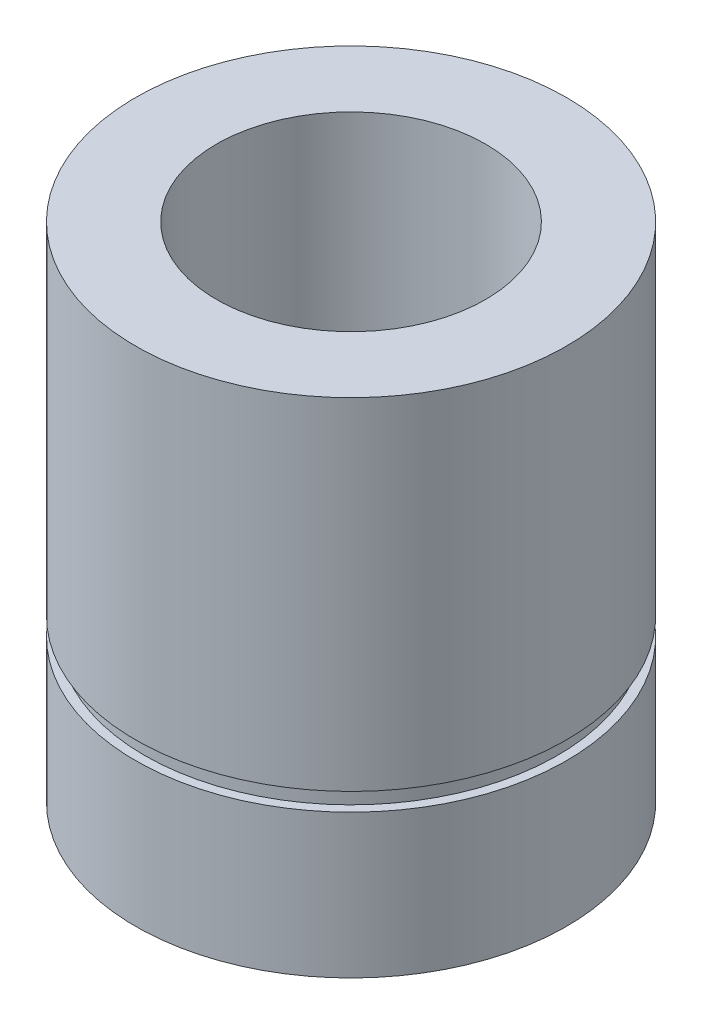
ISO-10303-21;
HEADER;
FILE_DESCRIPTION(('STEP AP214'),'2;1');
FILE_NAME('part.step','',(''),(''),'','','');
FILE_SCHEMA(('AUTOMOTIVE_DESIGN { 1 0 10303 214 1 1 1 1 }'));
ENDSEC;
DATA;
#1=APPLICATION_CONTEXT('core data for automotive mechanical design processes');
#2=APPLICATION_PROTOCOL_DEFINITION('international standard','automotive_design',2000,#1);
#3=PRODUCT_CONTEXT('',#1,'mechanical');
#4=PRODUCT('Part','Part','',(#3));
#5=PRODUCT_RELATED_PRODUCT_CATEGORY('part','',(#4));
#6=PRODUCT_DEFINITION_FORMATION('','',#4);
#7=PRODUCT_DEFINITION_CONTEXT('part definition',#1,'design');
#8=PRODUCT_DEFINITION('design','',#6,#7);
#9=PRODUCT_DEFINITION_SHAPE('','',#8);
#10=(LENGTH_UNIT() NAMED_UNIT(*) SI_UNIT(.MILLI.,.METRE.));
#11=(NAMED_UNIT(*) PLANE_ANGLE_UNIT() SI_UNIT($,.RADIAN.));
#12=(NAMED_UNIT(*) SI_UNIT($,.STERADIAN.) SOLID_ANGLE_UNIT());
#13=UNCERTAINTY_MEASURE_WITH_UNIT(LENGTH_MEASURE(1.E-05),#10,'distance_accuracy_value','');
#14=(GEOMETRIC_REPRESENTATION_CONTEXT(3) GLOBAL_UNCERTAINTY_ASSIGNED_CONTEXT((#13)) GLOBAL_UNIT_ASSIGNED_CONTEXT((#10,
#11,#12)) REPRESENTATION_CONTEXT('',''));
#15=CARTESIAN_POINT('',(0.,0.,0.));
#16=DIRECTION('',(0.,0.,1.));
#17=DIRECTION('',(1.,0.,0.));
#18=AXIS2_PLACEMENT_3D('',#15,#16,#17);
#19=CARTESIAN_POINT('',(0.,28.,0.));
#20=DIRECTION('',(0.,-1.,0.));
#21=DIRECTION('',(0.,0.,-1.));
#22=AXIS2_PLACEMENT_3D('',#19,#20,#21);
#23=CYLINDRICAL_SURFACE('',#22,12.);
#24=CARTESIAN_POINT('',(0.,0.,0.));
#25=DIRECTION('',(0.,-1.,0.));
#26=DIRECTION('',(0.,0.,-1.));
#27=AXIS2_PLACEMENT_3D('',#24,#25,#26);
#28=CIRCLE('',#27,12.);
#29=CARTESIAN_POINT('',(0.,0.,-12.));
#30=VERTEX_POINT('',#29);
#31=EDGE_CURVE('E16',#30,#30,#28,.F.);
#32=ORIENTED_EDGE('',*,*,#31,.T.);
#33=EDGE_LOOP('',(#32));
#34=FACE_BOUND('',#33,.T.);
#35=CARTESIAN_POINT('',(0.,8.,0.));
#36=DIRECTION('',(0.,-1.,0.));
#37=DIRECTION('',(0.,0.,-1.));
#38=AXIS2_PLACEMENT_3D('',#35,#36,#37);
#39=CIRCLE('',#38,12.);
#40=CARTESIAN_POINT('',(0.,8.,-12.));
#41=VERTEX_POINT('',#40);
#42=EDGE_CURVE('E38',#41,#41,#39,.T.);
#43=ORIENTED_EDGE('',*,*,#42,.T.);
#44=EDGE_LOOP('',(#43));
#45=FACE_BOUND('',#44,.T.);
#46=ADVANCED_FACE('F13',(#34,#45),#23,.T.);
#47=CARTESIAN_POINT('',(0.,0.,0.));
#48=DIRECTION('',(0.,1.,0.));
#49=DIRECTION('',(0.,0.,1.));
#50=AXIS2_PLACEMENT_3D('',#47,#48,#49);
#51=PLANE('',#50);
#52=CARTESIAN_POINT('',(0.,0.,0.));
#53=DIRECTION('',(0.,-1.,0.));
#54=DIRECTION('',(0.,0.,-1.));
#55=AXIS2_PLACEMENT_3D('',#52,#53,#54);
#56=CIRCLE('',#55,7.5);
#57=CARTESIAN_POINT('',(0.,0.,-7.5));
#58=VERTEX_POINT('',#57);
#59=EDGE_CURVE('E36',#58,#58,#56,.F.);
#60=ORIENTED_EDGE('',*,*,#59,.T.);
#61=EDGE_LOOP('',(#60));
#62=FACE_BOUND('',#61,.T.);
#63=ORIENTED_EDGE('',*,*,#31,.F.);
#64=EDGE_LOOP('',(#63));
#65=FACE_BOUND('',#64,.T.);
#66=ADVANCED_FACE('F46',(#62,#65),#51,.F.);
#67=CARTESIAN_POINT('',(0.,8.,0.));
#68=DIRECTION('',(0.,-1.,0.));
#69=DIRECTION('',(0.,0.,-1.));
#70=AXIS2_PLACEMENT_3D('',#67,#68,#69);
#71=PLANE('',#70);
#72=CARTESIAN_POINT('',(0.,8.,0.));
#73=DIRECTION('',(0.,1.,0.));
#74=DIRECTION('',(0.,0.,1.));
#75=AXIS2_PLACEMENT_3D('',#72,#73,#74);
#76=CIRCLE('',#75,11.5);
#77=CARTESIAN_POINT('',(0.,8.,11.5));
#78=VERTEX_POINT('',#77);
#79=EDGE_CURVE('E33',#78,#78,#76,.T.);
#80=ORIENTED_EDGE('',*,*,#79,.F.);
#81=EDGE_LOOP('',(#80));
#82=FACE_BOUND('',#81,.T.);
#83=ORIENTED_EDGE('',*,*,#42,.F.);
#84=EDGE_LOOP('',(#83));
#85=FACE_BOUND('',#84,.T.);
#86=ADVANCED_FACE('F48',(#82,#85),#71,.F.);
#87=CARTESIAN_POINT('',(0.,28.,0.));
#88=DIRECTION('',(0.,-1.,0.));
#89=DIRECTION('',(0.,0.,-1.));
#90=AXIS2_PLACEMENT_3D('',#87,#88,#89);
#91=CYLINDRICAL_SURFACE('',#90,7.5);
#92=CARTESIAN_POINT('',(0.,28.,0.));
#93=DIRECTION('',(0.,-1.,0.));
#94=DIRECTION('',(0.,0.,-1.));
#95=AXIS2_PLACEMENT_3D('',#92,#93,#94);
#96=CIRCLE('',#95,7.5);
#97=CARTESIAN_POINT('',(0.,28.,-7.5));
#98=VERTEX_POINT('',#97);
#99=EDGE_CURVE('E30',#98,#98,#96,.T.);
#100=ORIENTED_EDGE('',*,*,#99,.F.);
#101=EDGE_LOOP('',(#100));
#102=FACE_BOUND('',#101,.T.);
#103=ORIENTED_EDGE('',*,*,#59,.F.);
#104=EDGE_LOOP('',(#103));
#105=FACE_BOUND('',#104,.T.);
#106=ADVANCED_FACE('F55',(#102,#105),#91,.F.);
#107=CARTESIAN_POINT('',(0.,8.,0.));
#108=DIRECTION('',(0.,1.,0.));
#109=DIRECTION('',(0.,0.,1.));
#110=AXIS2_PLACEMENT_3D('',#107,#108,#109);
#111=CYLINDRICAL_SURFACE('',#110,11.5);
#112=CARTESIAN_POINT('',(0.,9.,0.));
#113=DIRECTION('',(0.,1.,0.));
#114=DIRECTION('',(0.,0.,1.));
#115=AXIS2_PLACEMENT_3D('',#112,#113,#114);
#116=CIRCLE('',#115,11.5);
#117=CARTESIAN_POINT('',(0.,9.,11.5));
#118=VERTEX_POINT('',#117);
#119=EDGE_CURVE('E25',#118,#118,#116,.T.);
#120=ORIENTED_EDGE('',*,*,#119,.F.);
#121=EDGE_LOOP('',(#120));
#122=FACE_BOUND('',#121,.T.);
#123=ORIENTED_EDGE('',*,*,#79,.T.);
#124=EDGE_LOOP('',(#123));
#125=FACE_BOUND('',#124,.T.);
#126=ADVANCED_FACE('F72',(#122,#125),#111,.T.);
#127=CARTESIAN_POINT('',(0.,28.,0.));
#128=DIRECTION('',(0.,1.,0.));
#129=DIRECTION('',(0.,0.,1.));
#130=AXIS2_PLACEMENT_3D('',#127,#128,#129);
#131=PLANE('',#130);
#132=ORIENTED_EDGE('',*,*,#99,.T.);
#133=EDGE_LOOP('',(#132));
#134=FACE_BOUND('',#133,.T.);
#135=CARTESIAN_POINT('',(0.,28.,0.));
#136=DIRECTION('',(0.,-1.,0.));
#137=DIRECTION('',(0.,0.,-1.));
#138=AXIS2_PLACEMENT_3D('',#135,#136,#137);
#139=CIRCLE('',#138,12.);
#140=CARTESIAN_POINT('',(0.,28.,-12.));
#141=VERTEX_POINT('',#140);
#142=EDGE_CURVE('E20',#141,#141,#139,.T.);
#143=ORIENTED_EDGE('',*,*,#142,.F.);
#144=EDGE_LOOP('',(#143));
#145=FACE_BOUND('',#144,.T.);
#146=ADVANCED_FACE('F65',(#134,#145),#131,.T.);
#147=CARTESIAN_POINT('',(0.,9.,0.));
#148=DIRECTION('',(0.,-1.,0.));
#149=DIRECTION('',(0.,0.,-1.));
#150=AXIS2_PLACEMENT_3D('',#147,#148,#149);
#151=PLANE('',#150);
#152=ORIENTED_EDGE('',*,*,#119,.T.);
#153=EDGE_LOOP('',(#152));
#154=FACE_BOUND('',#153,.T.);
#155=CARTESIAN_POINT('',(0.,9.,0.));
#156=DIRECTION('',(0.,-1.,0.));
#157=DIRECTION('',(0.,0.,-1.));
#158=AXIS2_PLACEMENT_3D('',#155,#156,#157);
#159=CIRCLE('',#158,12.);
#160=CARTESIAN_POINT('',(0.,9.,-12.));
#161=VERTEX_POINT('',#160);
#162=EDGE_CURVE('E9',#161,#161,#159,.F.);
#163=ORIENTED_EDGE('',*,*,#162,.F.);
#164=EDGE_LOOP('',(#163));
#165=FACE_BOUND('',#164,.T.);
#166=ADVANCED_FACE('F60',(#154,#165),#151,.T.);
#167=CARTESIAN_POINT('',(0.,28.,0.));
#168=DIRECTION('',(0.,-1.,0.));
#169=DIRECTION('',(0.,0.,-1.));
#170=AXIS2_PLACEMENT_3D('',#167,#168,#169);
#171=CYLINDRICAL_SURFACE('',#170,12.);
#172=ORIENTED_EDGE('',*,*,#162,.T.);
#173=EDGE_LOOP('',(#172));
#174=FACE_BOUND('',#173,.T.);
#175=ORIENTED_EDGE('',*,*,#142,.T.);
#176=EDGE_LOOP('',(#175));
#177=FACE_BOUND('',#176,.T.);
#178=ADVANCED_FACE('F58',(#174,#177),#171,.T.);
#179=CLOSED_SHELL('',(#46,#66,#86,#106,#126,#146,#166,#178));
#180=MANIFOLD_SOLID_BREP('B1',#179);
#181=ADVANCED_BREP_SHAPE_REPRESENTATION('',(#18,#180),#14);
#182=SHAPE_DEFINITION_REPRESENTATION(#9,#181);
ENDSEC;
END-ISO-10303-21;
